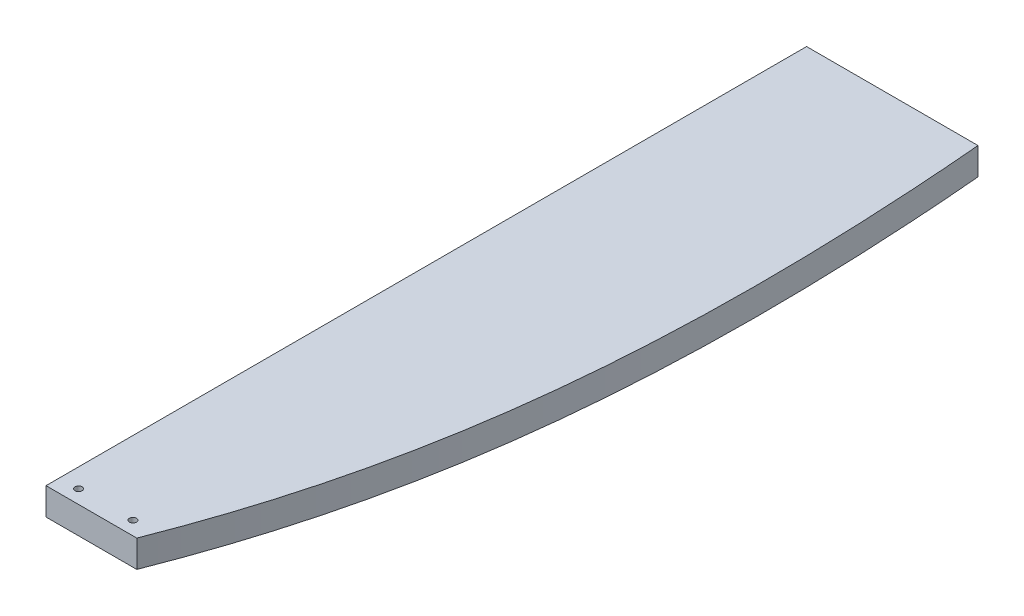
ISO-10303-21;
HEADER;
FILE_DESCRIPTION(('STEP AP214'),'2;1');
FILE_NAME('part.step','',(''),(''),'','','');
FILE_SCHEMA(('AUTOMOTIVE_DESIGN { 1 0 10303 214 1 1 1 1 }'));
ENDSEC;
DATA;
#1=APPLICATION_CONTEXT('core data for automotive mechanical design processes');
#2=APPLICATION_PROTOCOL_DEFINITION('international standard','automotive_design',2000,#1);
#3=PRODUCT_CONTEXT('',#1,'mechanical');
#4=PRODUCT('Part','Part','',(#3));
#5=PRODUCT_RELATED_PRODUCT_CATEGORY('part','',(#4));
#6=PRODUCT_DEFINITION_FORMATION('','',#4);
#7=PRODUCT_DEFINITION_CONTEXT('part definition',#1,'design');
#8=PRODUCT_DEFINITION('design','',#6,#7);
#9=PRODUCT_DEFINITION_SHAPE('','',#8);
#10=(LENGTH_UNIT() NAMED_UNIT(*) SI_UNIT(.MILLI.,.METRE.));
#11=(NAMED_UNIT(*) PLANE_ANGLE_UNIT() SI_UNIT($,.RADIAN.));
#12=(NAMED_UNIT(*) SI_UNIT($,.STERADIAN.) SOLID_ANGLE_UNIT());
#13=UNCERTAINTY_MEASURE_WITH_UNIT(LENGTH_MEASURE(1.E-05),#10,'distance_accuracy_value','');
#14=(GEOMETRIC_REPRESENTATION_CONTEXT(3) GLOBAL_UNCERTAINTY_ASSIGNED_CONTEXT((#13)) GLOBAL_UNIT_ASSIGNED_CONTEXT((#10,
#11,#12)) REPRESENTATION_CONTEXT('',''));
#15=CARTESIAN_POINT('',(0.,0.,0.));
#16=DIRECTION('',(0.,0.,1.));
#17=DIRECTION('',(1.,0.,0.));
#18=AXIS2_PLACEMENT_3D('',#15,#16,#17);
#19=CARTESIAN_POINT('',(389.5016067869,5194.3,2950.05622050593));
#20=DIRECTION('',(0.,1.,0.));
#21=DIRECTION('',(-1.,0.,0.));
#22=AXIS2_PLACEMENT_3D('',#19,#20,#21);
#23=PLANE('',#22);
#24=CARTESIAN_POINT('',(376.528681754765,5194.3,3207.07744091049));
#25=DIRECTION('',(0.,1.,0.));
#26=DIRECTION('',(-1.,0.,0.));
#27=AXIS2_PLACEMENT_3D('',#24,#25,#26);
#28=CIRCLE('',#27,2.45744999999997);
#29=CARTESIAN_POINT('',(374.071231754765,5194.3,3207.07744091049));
#30=VERTEX_POINT('',#29);
#31=EDGE_CURVE('E293',#30,#30,#28,.T.);
#32=ORIENTED_EDGE('',*,*,#31,.T.);
#33=EDGE_LOOP('',(#32));
#34=FACE_BOUND('',#33,.T.);
#35=CARTESIAN_POINT('',(338.428578956982,5194.3,3207.07744091058));
#36=DIRECTION('',(0.,1.,0.));
#37=DIRECTION('',(-1.,0.,0.));
#38=AXIS2_PLACEMENT_3D('',#35,#36,#37);
#39=CIRCLE('',#38,2.45744999999997);
#40=CARTESIAN_POINT('',(335.971128956982,5194.3,3207.07744091058));
#41=VERTEX_POINT('',#40);
#42=EDGE_CURVE('E42',#41,#41,#39,.T.);
#43=ORIENTED_EDGE('',*,*,#42,.T.);
#44=EDGE_LOOP('',(#43));
#45=FACE_BOUND('',#44,.T.);
#46=DIRECTION('',(-1.,0.,0.));
#47=VECTOR('',#46,1.);
#48=CARTESIAN_POINT('',(445.271141729743,5194.3,2683.51));
#49=LINE('',#48,#47);
#50=CARTESIAN_POINT('',(445.271141729743,5194.3,2683.51));
#51=VERTEX_POINT('',#50);
#52=CARTESIAN_POINT('',(325.12,5194.3,2683.51));
#53=VERTEX_POINT('',#52);
#54=EDGE_CURVE('E161',#51,#53,#49,.T.);
#55=ORIENTED_EDGE('',*,*,#54,.F.);
#56=CARTESIAN_POINT('',(388.748833209511,5194.3,3216.60244101189));
#57=CARTESIAN_POINT('',(389.522252968133,5194.3,3214.63182176014));
#58=CARTESIAN_POINT('',(390.28872172435,5194.3,3212.65847358438));
#59=CARTESIAN_POINT('',(391.807587176832,5194.3,3208.70646110342));
#60=CARTESIAN_POINT('',(392.559984442724,5194.3,3206.72779701715));
#61=CARTESIAN_POINT('',(394.050584006538,5194.3,3202.7651760804));
#62=CARTESIAN_POINT('',(394.788786601797,5194.3,3200.78121934178));
#63=CARTESIAN_POINT('',(396.251182478671,5194.3,3196.8072370958));
#64=CARTESIAN_POINT('',(396.975369962835,5194.3,3194.81720945522));
#65=CARTESIAN_POINT('',(398.409326379544,5194.3,3190.83191533539));
#66=CARTESIAN_POINT('',(399.119095003551,5194.3,3188.83664874507));
#67=CARTESIAN_POINT('',(400.524120705957,5194.3,3184.84092335103));
#68=CARTESIAN_POINT('',(401.219377144053,5194.3,3182.84046432257));
#69=CARTESIAN_POINT('',(403.979981150922,5194.3,3174.80275179745));
#70=CARTESIAN_POINT('',(405.986229361711,5194.3,3168.7450562538));
#71=CARTESIAN_POINT('',(409.864016063092,5194.3,3156.58584521959));
#72=CARTESIAN_POINT('',(411.735535675615,5194.3,3150.48432371938));
#73=CARTESIAN_POINT('',(415.342670234217,5194.3,3138.24071743662));
#74=CARTESIAN_POINT('',(417.078274865979,5194.3,3132.09862961383));
#75=CARTESIAN_POINT('',(420.413307310401,5194.3,3119.77755039309));
#76=CARTESIAN_POINT('',(422.012733917511,5194.3,3113.59855866895));
#77=CARTESIAN_POINT('',(425.076507654872,5194.3,3101.20582036093));
#78=CARTESIAN_POINT('',(426.540826480792,5194.3,3094.99206678251));
#79=CARTESIAN_POINT('',(429.335602965528,5194.3,3082.53477442042));
#80=CARTESIAN_POINT('',(430.666065285989,5194.3,3076.29123668194));
#81=CARTESIAN_POINT('',(433.195551254198,5194.3,3063.77787947901));
#82=CARTESIAN_POINT('',(434.394580050255,5194.3,3057.50806105398));
#83=CARTESIAN_POINT('',(436.664262798693,5194.3,3044.94572418597));
#84=CARTESIAN_POINT('',(437.734926596352,5194.3,3038.65320752207));
#85=CARTESIAN_POINT('',(439.412841289309,5194.3,3028.16585891989));
#86=CARTESIAN_POINT('',(440.054930598951,5194.3,3023.97656044391));
#87=CARTESIAN_POINT('',(441.285326649012,5194.3,3015.59028760335));
#88=CARTESIAN_POINT('',(441.87363620708,5194.3,3011.39331365267));
#89=CARTESIAN_POINT('',(442.997751229943,5194.3,3002.99243079538));
#90=CARTESIAN_POINT('',(443.533557687155,5194.3,2998.7885220214));
#91=CARTESIAN_POINT('',(444.553830346814,5194.3,2990.37588429152));
#92=CARTESIAN_POINT('',(445.038313336257,5194.3,2986.16715736967));
#93=CARTESIAN_POINT('',(445.95751189761,5194.3,2977.74420167879));
#94=CARTESIAN_POINT('',(446.392226612659,5194.3,2973.5299728163));
#95=CARTESIAN_POINT('',(447.213286250906,5194.3,2965.0967391719));
#96=CARTESIAN_POINT('',(447.599630208291,5194.3,2960.87773429633));
#97=CARTESIAN_POINT('',(448.610399554395,5194.3,2949.12002029531));
#98=CARTESIAN_POINT('',(449.183460079722,5194.3,2941.57684955928));
#99=CARTESIAN_POINT('',(450.188110587307,5194.3,2926.48082596249));
#100=CARTESIAN_POINT('',(450.61969436184,5194.3,2918.92797269146));
#101=CARTESIAN_POINT('',(451.167099565232,5194.3,2907.59393388459));
#102=CARTESIAN_POINT('',(451.332907313244,5194.3,2903.81509221511));
#103=CARTESIAN_POINT('',(451.632200630418,5194.3,2896.2561191346));
#104=CARTESIAN_POINT('',(451.765686187028,5194.3,2892.47598772308));
#105=CARTESIAN_POINT('',(452.001447257515,5194.3,2884.91259385326));
#106=CARTESIAN_POINT('',(452.103704889071,5194.3,2881.12933084029));
#107=CARTESIAN_POINT('',(452.277368935585,5194.3,2873.56209999784));
#108=CARTESIAN_POINT('',(452.348775360838,5194.3,2869.77813216859));
#109=CARTESIAN_POINT('',(452.462007398326,5194.3,2862.20982426264));
#110=CARTESIAN_POINT('',(452.503833548246,5194.3,2858.42548419396));
#111=CARTESIAN_POINT('',(452.558952189985,5194.3,2850.8566043691));
#112=CARTESIAN_POINT('',(452.572244665883,5194.3,2847.07206461283));
#113=CARTESIAN_POINT('',(452.570825815497,5194.3,2835.71848246225));
#114=CARTESIAN_POINT('',(452.51481925408,5194.3,2828.14940488104));
#115=CARTESIAN_POINT('',(452.325706518357,5194.3,2814.8576360439));
#116=CARTESIAN_POINT('',(452.21472141439,5194.3,2809.13460593405));
#117=CARTESIAN_POINT('',(451.936070151197,5194.3,2797.68993762865));
#118=CARTESIAN_POINT('',(451.768404183397,5194.3,2791.96829942846));
#119=CARTESIAN_POINT('',(451.378470854025,5194.3,2780.52685123598));
#120=CARTESIAN_POINT('',(451.156203086375,5194.3,2774.80704125759));
#121=CARTESIAN_POINT('',(450.658785505362,5194.3,2763.36967450208));
#122=CARTESIAN_POINT('',(450.383635226401,5194.3,2757.65211774522));
#123=CARTESIAN_POINT('',(449.782227506015,5194.3,2746.22711571753));
#124=CARTESIAN_POINT('',(449.456036663211,5194.3,2740.51966693659));
#125=CARTESIAN_POINT('',(448.75333687339,5194.3,2729.10791697049));
#126=CARTESIAN_POINT('',(448.376828318642,5194.3,2723.40361576115));
#127=CARTESIAN_POINT('',(447.574201897389,5194.3,2711.99864715379));
#128=CARTESIAN_POINT('',(447.148085321016,5194.3,2706.29797966515));
#129=CARTESIAN_POINT('',(446.471952170237,5194.3,2697.75005038914));
#130=CARTESIAN_POINT('',(446.240420243813,5194.3,2694.9013153148));
#131=CARTESIAN_POINT('',(445.765028486666,5194.3,2689.20487423171));
#132=CARTESIAN_POINT('',(445.521168656989,5194.3,2686.35716822288));
#133=CARTESIAN_POINT('',(445.271141729743,5194.3,2683.51));
#134=B_SPLINE_CURVE_WITH_KNOTS('',3,(#56,#57,#58,#59,#60,#61,#62,#63,#64,#65,#66,#67,#68,#69,
#70,#71,#72,#73,#74,#75,#76,#77,#78,#79,#80,#81,#82,#83,#84,#85,#86,#87,#88,#89,#90,#91,#92,#93,
#94,#95,#96,#97,#98,#99,#100,#101,#102,#103,#104,#105,#106,#107,#108,#109,#110,#111,#112,#113,
#114,#115,#116,#117,#118,#119,#120,#121,#122,#123,#124,#125,#126,#127,#128,#129,#130,#131,#132,
#133),.UNSPECIFIED.,.F.,.F.,(4,2,2,2,2,2,2,2,2,2,2,2,2,2,2,2,2,2,2,2,2,2,2,2,2,2,2,2,2,2,2,2,2,
2,2,2,2,2,4),(0.,6.35086701356905,12.7014763794555,19.0519525736819,25.4050018387978,
31.758186905569,38.1116516963092,57.2537350240522,76.3984953265151,95.5447070815523,
114.691088315577,133.841471545988,152.991187620061,172.140153323164,191.287649407017,
204.001986076296,216.715656228675,229.429086019741,242.138344550251,254.847821863679,
267.557552904961,290.250765480576,312.944973656978,324.292291318835,335.639613387368,
346.993421240414,358.347225304224,369.700822982525,381.054426996128,403.761418106075,
420.933479573431,438.10548304731,455.277614235263,472.449896620544,489.599956338762,
506.749882365398,523.899362482217,532.473724957063,541.04808670467),.UNSPECIFIED.);
#135=CARTESIAN_POINT('',(388.748833209511,5194.3,3216.60244101189));
#136=VERTEX_POINT('',#135);
#137=EDGE_CURVE('E69',#136,#51,#134,.T.);
#138=ORIENTED_EDGE('',*,*,#137,.F.);
#139=DIRECTION('',(1.,0.,0.));
#140=VECTOR('',#139,1.);
#141=CARTESIAN_POINT('',(325.12,5194.3,3216.60244101189));
#142=LINE('',#141,#140);
#143=CARTESIAN_POINT('',(325.12,5194.3,3216.60244101189));
#144=VERTEX_POINT('',#143);
#145=EDGE_CURVE('E75',#144,#136,#142,.T.);
#146=ORIENTED_EDGE('',*,*,#145,.F.);
#147=DIRECTION('',(0.,0.,1.));
#148=VECTOR('',#147,1.);
#149=CARTESIAN_POINT('',(325.12,5194.3,2683.51));
#150=LINE('',#149,#148);
#151=EDGE_CURVE('E83',#53,#144,#150,.T.);
#152=ORIENTED_EDGE('',*,*,#151,.F.);
#153=EDGE_LOOP('',(#55,#138,#146,#152));
#154=FACE_BOUND('',#153,.T.);
#155=ADVANCED_FACE('F35',(#34,#45,#154),#23,.F.);
#156=CARTESIAN_POINT('',(325.12,5194.3,2683.51));
#157=DIRECTION('',(-1.,0.,0.));
#158=DIRECTION('',(0.,-1.,0.));
#159=AXIS2_PLACEMENT_3D('',#156,#157,#158);
#160=PLANE('',#159);
#161=CARTESIAN_POINT('',(325.12,5203.825,2785.11));
#162=DIRECTION('',(-1.,0.,0.));
#163=DIRECTION('',(0.,-1.,0.));
#164=AXIS2_PLACEMENT_3D('',#161,#162,#163);
#165=CIRCLE('',#164,0.991870000000006);
#166=CARTESIAN_POINT('',(325.12,5202.83313,2785.11));
#167=VERTEX_POINT('',#166);
#168=EDGE_CURVE('E119',#167,#167,#165,.T.);
#169=ORIENTED_EDGE('',*,*,#168,.F.);
#170=EDGE_LOOP('',(#169));
#171=FACE_BOUND('',#170,.T.);
#172=CARTESIAN_POINT('',(325.12,5203.825,2886.71));
#173=DIRECTION('',(-1.,0.,0.));
#174=DIRECTION('',(0.,-1.,0.));
#175=AXIS2_PLACEMENT_3D('',#172,#173,#174);
#176=CIRCLE('',#175,0.991870000000006);
#177=CARTESIAN_POINT('',(325.12,5202.83313,2886.71));
#178=VERTEX_POINT('',#177);
#179=EDGE_CURVE('E130',#178,#178,#176,.T.);
#180=ORIENTED_EDGE('',*,*,#179,.F.);
#181=EDGE_LOOP('',(#180));
#182=FACE_BOUND('',#181,.T.);
#183=CARTESIAN_POINT('',(325.12,5203.825,2988.31));
#184=DIRECTION('',(-1.,0.,0.));
#185=DIRECTION('',(0.,-1.,0.));
#186=AXIS2_PLACEMENT_3D('',#183,#184,#185);
#187=CIRCLE('',#186,0.991870000000006);
#188=CARTESIAN_POINT('',(325.12,5202.83313,2988.31));
#189=VERTEX_POINT('',#188);
#190=EDGE_CURVE('E134',#189,#189,#187,.T.);
#191=ORIENTED_EDGE('',*,*,#190,.F.);
#192=EDGE_LOOP('',(#191));
#193=FACE_BOUND('',#192,.T.);
#194=CARTESIAN_POINT('',(325.12,5203.825,3089.91));
#195=DIRECTION('',(-1.,0.,0.));
#196=DIRECTION('',(0.,-1.,0.));
#197=AXIS2_PLACEMENT_3D('',#194,#195,#196);
#198=CIRCLE('',#197,0.991870000000006);
#199=CARTESIAN_POINT('',(325.12,5202.83313,3089.91));
#200=VERTEX_POINT('',#199);
#201=EDGE_CURVE('E138',#200,#200,#198,.T.);
#202=ORIENTED_EDGE('',*,*,#201,.F.);
#203=EDGE_LOOP('',(#202));
#204=FACE_BOUND('',#203,.T.);
#205=CARTESIAN_POINT('',(325.12,5203.825,3191.51));
#206=DIRECTION('',(-1.,0.,0.));
#207=DIRECTION('',(0.,-1.,0.));
#208=AXIS2_PLACEMENT_3D('',#205,#206,#207);
#209=CIRCLE('',#208,0.991870000000006);
#210=CARTESIAN_POINT('',(325.12,5202.83313,3191.51));
#211=VERTEX_POINT('',#210);
#212=EDGE_CURVE('E142',#211,#211,#209,.T.);
#213=ORIENTED_EDGE('',*,*,#212,.F.);
#214=EDGE_LOOP('',(#213));
#215=FACE_BOUND('',#214,.T.);
#216=DIRECTION('',(0.,0.,1.));
#217=VECTOR('',#216,1.);
#218=CARTESIAN_POINT('',(325.12,5213.35,2950.05622050593));
#219=LINE('',#218,#217);
#220=CARTESIAN_POINT('',(325.12,5213.35,2683.51));
#221=VERTEX_POINT('',#220);
#222=CARTESIAN_POINT('',(325.12,5213.35,3216.60244101189));
#223=VERTEX_POINT('',#222);
#224=EDGE_CURVE('E89',#221,#223,#219,.T.);
#225=ORIENTED_EDGE('',*,*,#224,.F.);
#226=DIRECTION('',(0.,1.,0.));
#227=VECTOR('',#226,1.);
#228=CARTESIAN_POINT('',(325.12,5194.3,2683.51));
#229=LINE('',#228,#227);
#230=EDGE_CURVE('E159',#53,#221,#229,.T.);
#231=ORIENTED_EDGE('',*,*,#230,.F.);
#232=ORIENTED_EDGE('',*,*,#151,.T.);
#233=DIRECTION('',(0.,1.,0.));
#234=VECTOR('',#233,1.);
#235=CARTESIAN_POINT('',(325.12,5194.3,3216.60244101189));
#236=LINE('',#235,#234);
#237=EDGE_CURVE('E170',#223,#144,#236,.F.);
#238=ORIENTED_EDGE('',*,*,#237,.F.);
#239=EDGE_LOOP('',(#225,#231,#232,#238));
#240=FACE_BOUND('',#239,.T.);
#241=ADVANCED_FACE('F212',(#171,#182,#193,#204,#215,#240),#160,.T.);
#242=CARTESIAN_POINT('',(325.12,5194.3,3216.60244101189));
#243=DIRECTION('',(0.,0.,1.));
#244=DIRECTION('',(1.,0.,0.));
#245=AXIS2_PLACEMENT_3D('',#242,#243,#244);
#246=PLANE('',#245);
#247=DIRECTION('',(-1.,0.,0.));
#248=VECTOR('',#247,1.);
#249=CARTESIAN_POINT('',(389.5016067869,5213.35,3216.60244101189));
#250=LINE('',#249,#248);
#251=CARTESIAN_POINT('',(388.748833209508,5213.35,3216.60244101189));
#252=VERTEX_POINT('',#251);
#253=EDGE_CURVE('E153',#223,#252,#250,.F.);
#254=ORIENTED_EDGE('',*,*,#253,.F.);
#255=ORIENTED_EDGE('',*,*,#237,.T.);
#256=ORIENTED_EDGE('',*,*,#145,.T.);
#257=DIRECTION('',(1.36956646082368E-13,-1.,0.));
#258=VECTOR('',#257,1.);
#259=CARTESIAN_POINT('',(388.74883320951,5203.825,3216.60244101189));
#260=LINE('',#259,#258);
#261=EDGE_CURVE('E167',#252,#136,#260,.T.);
#262=ORIENTED_EDGE('',*,*,#261,.F.);
#263=EDGE_LOOP('',(#254,#255,#256,#262));
#264=FACE_BOUND('',#263,.T.);
#265=ADVANCED_FACE('F209',(#264),#246,.T.);
#266=CARTESIAN_POINT('',(388.748833209511,5194.3,3216.60244101189));
#267=CARTESIAN_POINT('',(388.748833209509,5213.35,3216.60244101189));
#268=CARTESIAN_POINT('',(427.32827456289,5194.3,3118.30445867764));
#269=CARTESIAN_POINT('',(427.32827456289,5213.35,3118.30445867764));
#270=CARTESIAN_POINT('',(448.538626648826,5194.3,3013.430965814));
#271=CARTESIAN_POINT('',(448.538626648824,5213.35,3013.430965814));
#272=CARTESIAN_POINT('',(453.87526066603,5194.3,2815.15896694759));
#273=CARTESIAN_POINT('',(453.875260666027,5213.35,2815.15896694759));
#274=CARTESIAN_POINT('',(450.72161494878,5194.3,2745.57602142326));
#275=CARTESIAN_POINT('',(450.721614948777,5213.35,2745.57602142326));
#276=CARTESIAN_POINT('',(445.271141729743,5194.3,2683.51));
#277=CARTESIAN_POINT('',(445.271141729743,5213.35,2683.51));
#278=B_SPLINE_SURFACE_WITH_KNOTS('',3,1,((#266,#267),(#268,#269),(#270,#271),(#272,#273),(#274,
#275),(#276,#277)),.UNSPECIFIED.,.F.,.F.,.F.,(4,2,4),(2,2),(-53.1349686655124,-24.0856941468216,
-9.03456928373366),(0.,1.90499999999997),.UNSPECIFIED.);
#279=CARTESIAN_POINT('',(388.748833209509,5213.35,3216.60244101189));
#280=CARTESIAN_POINT('',(389.522252968131,5213.35,3214.63182176014));
#281=CARTESIAN_POINT('',(390.288721724347,5213.35,3212.65847358438));
#282=CARTESIAN_POINT('',(391.807587176829,5213.35,3208.70646110342));
#283=CARTESIAN_POINT('',(392.559984442721,5213.35,3206.72779701715));
#284=CARTESIAN_POINT('',(394.050584006536,5213.35,3202.7651760804));
#285=CARTESIAN_POINT('',(394.788786601795,5213.35,3200.78121934178));
#286=CARTESIAN_POINT('',(396.251182478668,5213.35,3196.8072370958));
#287=CARTESIAN_POINT('',(396.975369962833,5213.35,3194.81720945522));
#288=CARTESIAN_POINT('',(398.409326379543,5213.35,3190.8319153354));
#289=CARTESIAN_POINT('',(399.119095003549,5213.35,3188.83664874507));
#290=CARTESIAN_POINT('',(400.524120705955,5213.35,3184.84092335103));
#291=CARTESIAN_POINT('',(401.219377144051,5213.35,3182.84046432257));
#292=CARTESIAN_POINT('',(403.979981150921,5213.35,3174.80275179745));
#293=CARTESIAN_POINT('',(405.986229361709,5213.35,3168.7450562538));
#294=CARTESIAN_POINT('',(409.86401606309,5213.35,3156.58584521959));
#295=CARTESIAN_POINT('',(411.735535675613,5213.35,3150.48432371939));
#296=CARTESIAN_POINT('',(415.342670234215,5213.35,3138.24071743662));
#297=CARTESIAN_POINT('',(417.078274865977,5213.35,3132.09862961383));
#298=CARTESIAN_POINT('',(420.413307310399,5213.35,3119.77755039309));
#299=CARTESIAN_POINT('',(422.012733917509,5213.35,3113.59855866895));
#300=CARTESIAN_POINT('',(425.07650765487,5213.35,3101.20582036093));
#301=CARTESIAN_POINT('',(426.540826480791,5213.35,3094.99206678251));
#302=CARTESIAN_POINT('',(429.335602965527,5213.35,3082.53477442042));
#303=CARTESIAN_POINT('',(430.666065285987,5213.35,3076.29123668194));
#304=CARTESIAN_POINT('',(433.195551254196,5213.35,3063.77787947901));
#305=CARTESIAN_POINT('',(434.394580050254,5213.35,3057.50806105398));
#306=CARTESIAN_POINT('',(436.664262798691,5213.35,3044.94572418597));
#307=CARTESIAN_POINT('',(437.734926596351,5213.35,3038.65320752207));
#308=CARTESIAN_POINT('',(439.412841289306,5213.35,3028.16585891989));
#309=CARTESIAN_POINT('',(440.054930598949,5213.35,3023.97656044391));
#310=CARTESIAN_POINT('',(441.28532664901,5213.35,3015.59028760335));
#311=CARTESIAN_POINT('',(441.873636207078,5213.35,3011.39331365267));
#312=CARTESIAN_POINT('',(442.997751229941,5213.35,3002.99243079538));
#313=CARTESIAN_POINT('',(443.533557687153,5213.35,2998.7885220214));
#314=CARTESIAN_POINT('',(444.553830346812,5213.35,2990.37588429152));
#315=CARTESIAN_POINT('',(445.038313336254,5213.35,2986.16715736967));
#316=CARTESIAN_POINT('',(445.957511897608,5213.35,2977.74420167879));
#317=CARTESIAN_POINT('',(446.392226612657,5213.35,2973.5299728163));
#318=CARTESIAN_POINT('',(447.213286250903,5213.35,2965.0967391719));
#319=CARTESIAN_POINT('',(447.599630208289,5213.35,2960.87773429633));
#320=CARTESIAN_POINT('',(448.610399554392,5213.35,2949.12002029531));
#321=CARTESIAN_POINT('',(449.18346007972,5213.35,2941.57684955928));
#322=CARTESIAN_POINT('',(450.188110587305,5213.35,2926.48082596249));
#323=CARTESIAN_POINT('',(450.619694361838,5213.35,2918.92797269146));
#324=CARTESIAN_POINT('',(451.167099565229,5213.35,2907.5939338846));
#325=CARTESIAN_POINT('',(451.332907313242,5213.35,2903.81509221511));
#326=CARTESIAN_POINT('',(451.632200630416,5213.35,2896.2561191346));
#327=CARTESIAN_POINT('',(451.765686187025,5213.35,2892.47598772308));
#328=CARTESIAN_POINT('',(452.001447257512,5213.35,2884.91259385326));
#329=CARTESIAN_POINT('',(452.103704889069,5213.35,2881.12933084029));
#330=CARTESIAN_POINT('',(452.277368935582,5213.35,2873.56209999784));
#331=CARTESIAN_POINT('',(452.348775360836,5213.35,2869.77813216859));
#332=CARTESIAN_POINT('',(452.462007398323,5213.35,2862.20982426264));
#333=CARTESIAN_POINT('',(452.503833548243,5213.35,2858.42548419396));
#334=CARTESIAN_POINT('',(452.558952189982,5213.35,2850.8566043691));
#335=CARTESIAN_POINT('',(452.57224466588,5213.35,2847.07206461283));
#336=CARTESIAN_POINT('',(452.570825815494,5213.35,2835.71848246225));
#337=CARTESIAN_POINT('',(452.514819254078,5213.35,2828.14940488104));
#338=CARTESIAN_POINT('',(452.325706518355,5213.35,2814.8576360439));
#339=CARTESIAN_POINT('',(452.214721414387,5213.35,2809.13460593405));
#340=CARTESIAN_POINT('',(451.936070151195,5213.35,2797.68993762865));
#341=CARTESIAN_POINT('',(451.768404183394,5213.35,2791.96829942846));
#342=CARTESIAN_POINT('',(451.378470854023,5213.35,2780.52685123598));
#343=CARTESIAN_POINT('',(451.156203086373,5213.35,2774.80704125759));
#344=CARTESIAN_POINT('',(450.65878550536,5213.35,2763.36967450208));
#345=CARTESIAN_POINT('',(450.383635226399,5213.35,2757.65211774522));
#346=CARTESIAN_POINT('',(449.782227506013,5213.35,2746.22711571753));
#347=CARTESIAN_POINT('',(449.45603666321,5213.35,2740.51966693659));
#348=CARTESIAN_POINT('',(448.753336873389,5213.35,2729.10791697049));
#349=CARTESIAN_POINT('',(448.376828318641,5213.35,2723.40361576115));
#350=CARTESIAN_POINT('',(447.574201897389,5213.35,2711.99864715379));
#351=CARTESIAN_POINT('',(447.148085321015,5213.35,2706.29797966515));
#352=CARTESIAN_POINT('',(446.471952170236,5213.35,2697.75005038914));
#353=CARTESIAN_POINT('',(446.240420243812,5213.35,2694.9013153148));
#354=CARTESIAN_POINT('',(445.765028486666,5213.35,2689.20487423171));
#355=CARTESIAN_POINT('',(445.521168656989,5213.35,2686.35716822288));
#356=CARTESIAN_POINT('',(445.271141729743,5213.35,2683.51));
#357=B_SPLINE_CURVE_WITH_KNOTS('',3,(#279,#280,#281,#282,#283,#284,#285,#286,#287,#288,#289,
#290,#291,#292,#293,#294,#295,#296,#297,#298,#299,#300,#301,#302,#303,#304,#305,#306,#307,#308,
#309,#310,#311,#312,#313,#314,#315,#316,#317,#318,#319,#320,#321,#322,#323,#324,#325,#326,#327,
#328,#329,#330,#331,#332,#333,#334,#335,#336,#337,#338,#339,#340,#341,#342,#343,#344,#345,#346,
#347,#348,#349,#350,#351,#352,#353,#354,#355,#356),.UNSPECIFIED.,.F.,.F.,(4,2,2,2,2,2,2,2,2,2,2,
2,2,2,2,2,2,2,2,2,2,2,2,2,2,2,2,2,2,2,2,2,2,2,2,2,2,2,4),(0.,6.350867013569,12.7014763794554,
19.0519525736821,25.4050018387976,31.7581869055693,38.1116516963095,57.2537350240521,
76.3984953265144,95.5447070815521,114.691088315577,133.841471545987,152.991187620061,
172.140153323164,191.287649407017,204.001986076297,216.715656228674,229.42908601974,
242.138344550251,254.847821863678,267.55755290496,290.250765480575,312.944973656977,
324.292291318834,335.639613387368,346.993421240414,358.347225304224,369.700822982525,
381.054426996129,403.761418106075,420.933479573431,438.10548304731,455.277614235263,
472.449896620544,489.599956338762,506.749882365399,523.899362482218,532.473724957063,
541.04808670467),.UNSPECIFIED.);
#358=CARTESIAN_POINT('',(445.271141729743,5213.35,2683.51));
#359=VERTEX_POINT('',#358);
#360=EDGE_CURVE('E48',#252,#359,#357,.T.);
#361=DIRECTION('',(0.,1.,0.));
#362=VECTOR('',#361,1.);
#363=CARTESIAN_POINT('',(445.271141729743,5194.3,2683.51));
#364=LINE('',#363,#362);
#365=EDGE_CURVE('E57',#359,#51,#364,.F.);
#366=ORIENTED_EDGE('',*,*,#360,.F.);
#367=ORIENTED_EDGE('',*,*,#261,.T.);
#368=ORIENTED_EDGE('',*,*,#137,.T.);
#369=ORIENTED_EDGE('',*,*,#365,.F.);
#370=EDGE_LOOP('',(#366,#367,#368,#369));
#371=FACE_BOUND('',#370,.T.);
#372=ADVANCED_FACE('F37',(#371),#278,.T.);
#373=CARTESIAN_POINT('',(445.271141729743,5194.3,2683.51));
#374=DIRECTION('',(0.,0.,-1.));
#375=DIRECTION('',(-1.,0.,0.));
#376=AXIS2_PLACEMENT_3D('',#373,#374,#375);
#377=PLANE('',#376);
#378=CARTESIAN_POINT('',(414.990074060502,5203.825,2683.51));
#379=DIRECTION('',(0.,0.,-1.));
#380=DIRECTION('',(-1.,0.,0.));
#381=AXIS2_PLACEMENT_3D('',#378,#379,#380);
#382=CIRCLE('',#381,0.991870000000006);
#383=CARTESIAN_POINT('',(413.998204060502,5203.825,2683.51));
#384=VERTEX_POINT('',#383);
#385=EDGE_CURVE('E146',#384,#384,#382,.T.);
#386=ORIENTED_EDGE('',*,*,#385,.F.);
#387=EDGE_LOOP('',(#386));
#388=FACE_BOUND('',#387,.T.);
#389=CARTESIAN_POINT('',(355.076691353501,5203.825,2683.51));
#390=DIRECTION('',(0.,0.,-1.));
#391=DIRECTION('',(-1.,0.,0.));
#392=AXIS2_PLACEMENT_3D('',#389,#390,#391);
#393=CIRCLE('',#392,0.991870000000006);
#394=CARTESIAN_POINT('',(354.084821353501,5203.825,2683.51));
#395=VERTEX_POINT('',#394);
#396=EDGE_CURVE('E149',#395,#395,#393,.T.);
#397=ORIENTED_EDGE('',*,*,#396,.F.);
#398=EDGE_LOOP('',(#397));
#399=FACE_BOUND('',#398,.T.);
#400=DIRECTION('',(-1.,0.,0.));
#401=VECTOR('',#400,1.);
#402=CARTESIAN_POINT('',(389.5016067869,5213.35,2683.51));
#403=LINE('',#402,#401);
#404=EDGE_CURVE('E11',#359,#221,#403,.T.);
#405=ORIENTED_EDGE('',*,*,#404,.F.);
#406=ORIENTED_EDGE('',*,*,#365,.T.);
#407=ORIENTED_EDGE('',*,*,#54,.T.);
#408=ORIENTED_EDGE('',*,*,#230,.T.);
#409=EDGE_LOOP('',(#405,#406,#407,#408));
#410=FACE_BOUND('',#409,.T.);
#411=ADVANCED_FACE('F203',(#388,#399,#410),#377,.T.);
#412=CARTESIAN_POINT('',(389.5016067869,5213.35,2950.05622050593));
#413=DIRECTION('',(0.,1.,0.));
#414=DIRECTION('',(-1.,0.,0.));
#415=AXIS2_PLACEMENT_3D('',#412,#413,#414);
#416=PLANE('',#415);
#417=CARTESIAN_POINT('',(376.528681754765,5213.35,3207.07744091049));
#418=DIRECTION('',(0.,1.,0.));
#419=DIRECTION('',(0.,0.,1.));
#420=AXIS2_PLACEMENT_3D('',#417,#418,#419);
#421=CIRCLE('',#420,2.45744999999997);
#422=CARTESIAN_POINT('',(376.528681754765,5213.35,3209.53489091049));
#423=VERTEX_POINT('',#422);
#424=EDGE_CURVE('E291',#423,#423,#421,.T.);
#425=ORIENTED_EDGE('',*,*,#424,.F.);
#426=EDGE_LOOP('',(#425));
#427=FACE_BOUND('',#426,.T.);
#428=CARTESIAN_POINT('',(338.428578956982,5213.35,3207.07744091058));
#429=DIRECTION('',(0.,1.,0.));
#430=DIRECTION('',(0.,0.,1.));
#431=AXIS2_PLACEMENT_3D('',#428,#429,#430);
#432=CIRCLE('',#431,2.45744999999997);
#433=CARTESIAN_POINT('',(338.428578956982,5213.35,3209.53489091058));
#434=VERTEX_POINT('',#433);
#435=EDGE_CURVE('E124',#434,#434,#432,.T.);
#436=ORIENTED_EDGE('',*,*,#435,.F.);
#437=EDGE_LOOP('',(#436));
#438=FACE_BOUND('',#437,.T.);
#439=ORIENTED_EDGE('',*,*,#360,.T.);
#440=ORIENTED_EDGE('',*,*,#404,.T.);
#441=ORIENTED_EDGE('',*,*,#224,.T.);
#442=ORIENTED_EDGE('',*,*,#253,.T.);
#443=EDGE_LOOP('',(#439,#440,#441,#442));
#444=FACE_BOUND('',#443,.T.);
#445=ADVANCED_FACE('F197',(#427,#438,#444),#416,.T.);
#446=CARTESIAN_POINT('',(355.076691353501,5203.825,2702.56));
#447=DIRECTION('',(0.,0.,-1.));
#448=DIRECTION('',(-1.,0.,0.));
#449=AXIS2_PLACEMENT_3D('',#446,#447,#448);
#450=CONICAL_SURFACE('',#449,0.991870000000006,1.02974425867677);
#451=CARTESIAN_POINT('',(355.076691353501,5203.825,2703.1559756222));
#452=VERTEX_POINT('',#451);
#453=VERTEX_LOOP('',#452);
#454=FACE_BOUND('',#453,.T.);
#455=CARTESIAN_POINT('',(355.076691353501,5203.825,2702.56));
#456=DIRECTION('',(0.,0.,-1.));
#457=DIRECTION('',(-1.,0.,0.));
#458=AXIS2_PLACEMENT_3D('',#455,#456,#457);
#459=CIRCLE('',#458,0.991870000000006);
#460=CARTESIAN_POINT('',(354.084821353501,5203.825,2702.56));
#461=VERTEX_POINT('',#460);
#462=EDGE_CURVE('E147',#461,#461,#459,.T.);
#463=ORIENTED_EDGE('',*,*,#462,.T.);
#464=EDGE_LOOP('',(#463));
#465=FACE_BOUND('',#464,.T.);
#466=ADVANCED_FACE('F202',(#454,#465),#450,.F.);
#467=CARTESIAN_POINT('',(355.076691353501,5203.825,2664.46));
#468=DIRECTION('',(0.,0.,-1.));
#469=DIRECTION('',(-1.,0.,0.));
#470=AXIS2_PLACEMENT_3D('',#467,#468,#469);
#471=CYLINDRICAL_SURFACE('',#470,0.991870000000006);
#472=ORIENTED_EDGE('',*,*,#396,.T.);
#473=EDGE_LOOP('',(#472));
#474=FACE_BOUND('',#473,.T.);
#475=ORIENTED_EDGE('',*,*,#462,.F.);
#476=EDGE_LOOP('',(#475));
#477=FACE_BOUND('',#476,.T.);
#478=ADVANCED_FACE('F224',(#474,#477),#471,.F.);
#479=CARTESIAN_POINT('',(414.990074060502,5203.825,2702.56));
#480=DIRECTION('',(0.,0.,-1.));
#481=DIRECTION('',(-1.,0.,0.));
#482=AXIS2_PLACEMENT_3D('',#479,#480,#481);
#483=CONICAL_SURFACE('',#482,0.991870000000006,1.02974425867677);
#484=CARTESIAN_POINT('',(414.990074060502,5203.825,2703.1559756222));
#485=VERTEX_POINT('',#484);
#486=VERTEX_LOOP('',#485);
#487=FACE_BOUND('',#486,.T.);
#488=CARTESIAN_POINT('',(414.990074060502,5203.825,2702.56));
#489=DIRECTION('',(0.,0.,-1.));
#490=DIRECTION('',(-1.,0.,0.));
#491=AXIS2_PLACEMENT_3D('',#488,#489,#490);
#492=CIRCLE('',#491,0.991870000000006);
#493=CARTESIAN_POINT('',(413.998204060502,5203.825,2702.56));
#494=VERTEX_POINT('',#493);
#495=EDGE_CURVE('E143',#494,#494,#492,.T.);
#496=ORIENTED_EDGE('',*,*,#495,.T.);
#497=EDGE_LOOP('',(#496));
#498=FACE_BOUND('',#497,.T.);
#499=ADVANCED_FACE('F229',(#487,#498),#483,.F.);
#500=CARTESIAN_POINT('',(414.990074060502,5203.825,2664.46));
#501=DIRECTION('',(0.,0.,-1.));
#502=DIRECTION('',(-1.,0.,0.));
#503=AXIS2_PLACEMENT_3D('',#500,#501,#502);
#504=CYLINDRICAL_SURFACE('',#503,0.991870000000006);
#505=ORIENTED_EDGE('',*,*,#385,.T.);
#506=EDGE_LOOP('',(#505));
#507=FACE_BOUND('',#506,.T.);
#508=ORIENTED_EDGE('',*,*,#495,.F.);
#509=EDGE_LOOP('',(#508));
#510=FACE_BOUND('',#509,.T.);
#511=ADVANCED_FACE('F237',(#507,#510),#504,.F.);
#512=CARTESIAN_POINT('',(344.17,5203.825,3191.51));
#513=DIRECTION('',(-1.,0.,0.));
#514=DIRECTION('',(0.,0.,1.));
#515=AXIS2_PLACEMENT_3D('',#512,#513,#514);
#516=CONICAL_SURFACE('',#515,0.991870000000006,1.02974425867665);
#517=CARTESIAN_POINT('',(344.765975622195,5203.825,3191.51));
#518=VERTEX_POINT('',#517);
#519=VERTEX_LOOP('',#518);
#520=FACE_BOUND('',#519,.T.);
#521=CARTESIAN_POINT('',(344.17,5203.825,3191.51));
#522=DIRECTION('',(-1.,0.,0.));
#523=DIRECTION('',(0.,0.,1.));
#524=AXIS2_PLACEMENT_3D('',#521,#522,#523);
#525=CIRCLE('',#524,0.991870000000006);
#526=CARTESIAN_POINT('',(344.17,5203.825,3192.50187));
#527=VERTEX_POINT('',#526);
#528=EDGE_CURVE('E139',#527,#527,#525,.T.);
#529=ORIENTED_EDGE('',*,*,#528,.T.);
#530=EDGE_LOOP('',(#529));
#531=FACE_BOUND('',#530,.T.);
#532=ADVANCED_FACE('F244',(#520,#531),#516,.F.);
#533=CARTESIAN_POINT('',(312.42,5203.825,3191.51));
#534=DIRECTION('',(-1.,0.,0.));
#535=DIRECTION('',(0.,0.,1.));
#536=AXIS2_PLACEMENT_3D('',#533,#534,#535);
#537=CYLINDRICAL_SURFACE('',#536,0.991870000000006);
#538=ORIENTED_EDGE('',*,*,#212,.T.);
#539=EDGE_LOOP('',(#538));
#540=FACE_BOUND('',#539,.T.);
#541=ORIENTED_EDGE('',*,*,#528,.F.);
#542=EDGE_LOOP('',(#541));
#543=FACE_BOUND('',#542,.T.);
#544=ADVANCED_FACE('F248',(#540,#543),#537,.F.);
#545=CARTESIAN_POINT('',(344.17,5203.825,3089.91));
#546=DIRECTION('',(-1.,0.,0.));
#547=DIRECTION('',(0.,0.,1.));
#548=AXIS2_PLACEMENT_3D('',#545,#546,#547);
#549=CONICAL_SURFACE('',#548,0.991870000000006,1.02974425867665);
#550=CARTESIAN_POINT('',(344.765975622195,5203.825,3089.91));
#551=VERTEX_POINT('',#550);
#552=VERTEX_LOOP('',#551);
#553=FACE_BOUND('',#552,.T.);
#554=CARTESIAN_POINT('',(344.17,5203.825,3089.91));
#555=DIRECTION('',(-1.,0.,0.));
#556=DIRECTION('',(0.,0.,1.));
#557=AXIS2_PLACEMENT_3D('',#554,#555,#556);
#558=CIRCLE('',#557,0.991870000000006);
#559=CARTESIAN_POINT('',(344.17,5203.825,3090.90187));
#560=VERTEX_POINT('',#559);
#561=EDGE_CURVE('E135',#560,#560,#558,.T.);
#562=ORIENTED_EDGE('',*,*,#561,.T.);
#563=EDGE_LOOP('',(#562));
#564=FACE_BOUND('',#563,.T.);
#565=ADVANCED_FACE('F252',(#553,#564),#549,.F.);
#566=CARTESIAN_POINT('',(312.42,5203.825,3089.91));
#567=DIRECTION('',(-1.,0.,0.));
#568=DIRECTION('',(0.,0.,1.));
#569=AXIS2_PLACEMENT_3D('',#566,#567,#568);
#570=CYLINDRICAL_SURFACE('',#569,0.991870000000006);
#571=ORIENTED_EDGE('',*,*,#201,.T.);
#572=EDGE_LOOP('',(#571));
#573=FACE_BOUND('',#572,.T.);
#574=ORIENTED_EDGE('',*,*,#561,.F.);
#575=EDGE_LOOP('',(#574));
#576=FACE_BOUND('',#575,.T.);
#577=ADVANCED_FACE('F256',(#573,#576),#570,.F.);
#578=CARTESIAN_POINT('',(344.17,5203.825,2988.31));
#579=DIRECTION('',(-1.,0.,0.));
#580=DIRECTION('',(0.,0.,1.));
#581=AXIS2_PLACEMENT_3D('',#578,#579,#580);
#582=CONICAL_SURFACE('',#581,0.991870000000006,1.02974425867665);
#583=CARTESIAN_POINT('',(344.765975622195,5203.825,2988.31));
#584=VERTEX_POINT('',#583);
#585=VERTEX_LOOP('',#584);
#586=FACE_BOUND('',#585,.T.);
#587=CARTESIAN_POINT('',(344.17,5203.825,2988.31));
#588=DIRECTION('',(-1.,0.,0.));
#589=DIRECTION('',(0.,0.,1.));
#590=AXIS2_PLACEMENT_3D('',#587,#588,#589);
#591=CIRCLE('',#590,0.991870000000006);
#592=CARTESIAN_POINT('',(344.17,5203.825,2989.30187));
#593=VERTEX_POINT('',#592);
#594=EDGE_CURVE('E131',#593,#593,#591,.T.);
#595=ORIENTED_EDGE('',*,*,#594,.T.);
#596=EDGE_LOOP('',(#595));
#597=FACE_BOUND('',#596,.T.);
#598=ADVANCED_FACE('F260',(#586,#597),#582,.F.);
#599=CARTESIAN_POINT('',(312.42,5203.825,2988.31));
#600=DIRECTION('',(-1.,0.,0.));
#601=DIRECTION('',(0.,0.,1.));
#602=AXIS2_PLACEMENT_3D('',#599,#600,#601);
#603=CYLINDRICAL_SURFACE('',#602,0.991870000000006);
#604=ORIENTED_EDGE('',*,*,#190,.T.);
#605=EDGE_LOOP('',(#604));
#606=FACE_BOUND('',#605,.T.);
#607=ORIENTED_EDGE('',*,*,#594,.F.);
#608=EDGE_LOOP('',(#607));
#609=FACE_BOUND('',#608,.T.);
#610=ADVANCED_FACE('F264',(#606,#609),#603,.F.);
#611=CARTESIAN_POINT('',(344.17,5203.825,2886.71));
#612=DIRECTION('',(-1.,0.,0.));
#613=DIRECTION('',(0.,0.,1.));
#614=AXIS2_PLACEMENT_3D('',#611,#612,#613);
#615=CONICAL_SURFACE('',#614,0.991870000000006,1.02974425867665);
#616=CARTESIAN_POINT('',(344.765975622195,5203.825,2886.71));
#617=VERTEX_POINT('',#616);
#618=VERTEX_LOOP('',#617);
#619=FACE_BOUND('',#618,.T.);
#620=CARTESIAN_POINT('',(344.17,5203.825,2886.71));
#621=DIRECTION('',(-1.,0.,0.));
#622=DIRECTION('',(0.,0.,1.));
#623=AXIS2_PLACEMENT_3D('',#620,#621,#622);
#624=CIRCLE('',#623,0.991870000000006);
#625=CARTESIAN_POINT('',(344.17,5203.825,2887.70187));
#626=VERTEX_POINT('',#625);
#627=EDGE_CURVE('E122',#626,#626,#624,.T.);
#628=ORIENTED_EDGE('',*,*,#627,.T.);
#629=EDGE_LOOP('',(#628));
#630=FACE_BOUND('',#629,.T.);
#631=ADVANCED_FACE('F268',(#619,#630),#615,.F.);
#632=CARTESIAN_POINT('',(312.42,5203.825,2886.71));
#633=DIRECTION('',(-1.,0.,0.));
#634=DIRECTION('',(0.,0.,1.));
#635=AXIS2_PLACEMENT_3D('',#632,#633,#634);
#636=CYLINDRICAL_SURFACE('',#635,0.991870000000006);
#637=ORIENTED_EDGE('',*,*,#179,.T.);
#638=EDGE_LOOP('',(#637));
#639=FACE_BOUND('',#638,.T.);
#640=ORIENTED_EDGE('',*,*,#627,.F.);
#641=EDGE_LOOP('',(#640));
#642=FACE_BOUND('',#641,.T.);
#643=ADVANCED_FACE('F113',(#639,#642),#636,.F.);
#644=CARTESIAN_POINT('',(344.17,5203.825,2785.11));
#645=DIRECTION('',(-1.,0.,0.));
#646=DIRECTION('',(0.,0.,1.));
#647=AXIS2_PLACEMENT_3D('',#644,#645,#646);
#648=CONICAL_SURFACE('',#647,0.991870000000006,1.02974425867665);
#649=CARTESIAN_POINT('',(344.765975622195,5203.825,2785.11));
#650=VERTEX_POINT('',#649);
#651=VERTEX_LOOP('',#650);
#652=FACE_BOUND('',#651,.T.);
#653=CARTESIAN_POINT('',(344.17,5203.825,2785.11));
#654=DIRECTION('',(-1.,0.,0.));
#655=DIRECTION('',(0.,0.,1.));
#656=AXIS2_PLACEMENT_3D('',#653,#654,#655);
#657=CIRCLE('',#656,0.991870000000006);
#658=CARTESIAN_POINT('',(344.17,5203.825,2786.10187));
#659=VERTEX_POINT('',#658);
#660=EDGE_CURVE('E117',#659,#659,#657,.T.);
#661=ORIENTED_EDGE('',*,*,#660,.T.);
#662=EDGE_LOOP('',(#661));
#663=FACE_BOUND('',#662,.T.);
#664=ADVANCED_FACE('F109',(#652,#663),#648,.F.);
#665=CARTESIAN_POINT('',(312.42,5203.825,2785.11));
#666=DIRECTION('',(-1.,0.,0.));
#667=DIRECTION('',(0.,0.,1.));
#668=AXIS2_PLACEMENT_3D('',#665,#666,#667);
#669=CYLINDRICAL_SURFACE('',#668,0.991870000000006);
#670=ORIENTED_EDGE('',*,*,#168,.T.);
#671=EDGE_LOOP('',(#670));
#672=FACE_BOUND('',#671,.T.);
#673=ORIENTED_EDGE('',*,*,#660,.F.);
#674=EDGE_LOOP('',(#673));
#675=FACE_BOUND('',#674,.T.);
#676=ADVANCED_FACE('F112',(#672,#675),#669,.F.);
#677=CARTESIAN_POINT('',(338.428578956982,5213.35,3207.07744091058));
#678=DIRECTION('',(0.,1.,0.));
#679=DIRECTION('',(0.,0.,1.));
#680=AXIS2_PLACEMENT_3D('',#677,#678,#679);
#681=CYLINDRICAL_SURFACE('',#680,2.45744999999997);
#682=ORIENTED_EDGE('',*,*,#435,.T.);
#683=EDGE_LOOP('',(#682));
#684=FACE_BOUND('',#683,.T.);
#685=ORIENTED_EDGE('',*,*,#42,.F.);
#686=EDGE_LOOP('',(#685));
#687=FACE_BOUND('',#686,.T.);
#688=ADVANCED_FACE('F278',(#684,#687),#681,.F.);
#689=CARTESIAN_POINT('',(376.528681754765,5213.35,3207.07744091049));
#690=DIRECTION('',(0.,1.,0.));
#691=DIRECTION('',(0.,0.,1.));
#692=AXIS2_PLACEMENT_3D('',#689,#690,#691);
#693=CYLINDRICAL_SURFACE('',#692,2.45744999999997);
#694=ORIENTED_EDGE('',*,*,#424,.T.);
#695=EDGE_LOOP('',(#694));
#696=FACE_BOUND('',#695,.T.);
#697=ORIENTED_EDGE('',*,*,#31,.F.);
#698=EDGE_LOOP('',(#697));
#699=FACE_BOUND('',#698,.T.);
#700=ADVANCED_FACE('F282',(#696,#699),#693,.F.);
#701=CLOSED_SHELL('',(#155,#241,#265,#372,#411,#445,#466,#478,#499,#511,#532,#544,#565,#577,
#598,#610,#631,#643,#664,#676,#688,#700));
#702=MANIFOLD_SOLID_BREP('B2',#701);
#703=ADVANCED_BREP_SHAPE_REPRESENTATION('',(#18,#702),#14);
#704=SHAPE_DEFINITION_REPRESENTATION(#9,#703);
ENDSEC;
END-ISO-10303-21;
